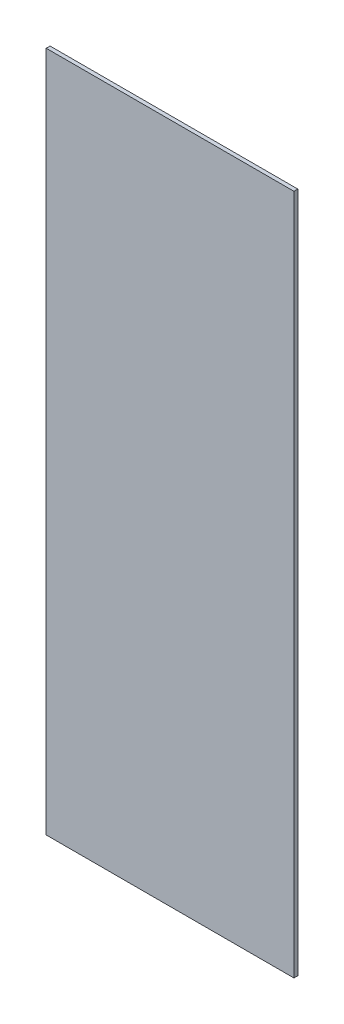
ISO-10303-21;
HEADER;
FILE_DESCRIPTION(('STEP AP214'),'2;1');
FILE_NAME('part.step','',(''),(''),'','','');
FILE_SCHEMA(('AUTOMOTIVE_DESIGN { 1 0 10303 214 1 1 1 1 }'));
ENDSEC;
DATA;
#1=APPLICATION_CONTEXT('core data for automotive mechanical design processes');
#2=APPLICATION_PROTOCOL_DEFINITION('international standard','automotive_design',2000,#1);
#3=PRODUCT_CONTEXT('',#1,'mechanical');
#4=PRODUCT('Part','Part','',(#3));
#5=PRODUCT_RELATED_PRODUCT_CATEGORY('part','',(#4));
#6=PRODUCT_DEFINITION_FORMATION('','',#4);
#7=PRODUCT_DEFINITION_CONTEXT('part definition',#1,'design');
#8=PRODUCT_DEFINITION('design','',#6,#7);
#9=PRODUCT_DEFINITION_SHAPE('','',#8);
#10=(LENGTH_UNIT() NAMED_UNIT(*) SI_UNIT(.MILLI.,.METRE.));
#11=(NAMED_UNIT(*) PLANE_ANGLE_UNIT() SI_UNIT($,.RADIAN.));
#12=(NAMED_UNIT(*) SI_UNIT($,.STERADIAN.) SOLID_ANGLE_UNIT());
#13=UNCERTAINTY_MEASURE_WITH_UNIT(LENGTH_MEASURE(1.E-05),#10,'distance_accuracy_value','');
#14=(GEOMETRIC_REPRESENTATION_CONTEXT(3) GLOBAL_UNCERTAINTY_ASSIGNED_CONTEXT((#13)) GLOBAL_UNIT_ASSIGNED_CONTEXT((#10,
#11,#12)) REPRESENTATION_CONTEXT('',''));
#15=CARTESIAN_POINT('',(0.,0.,0.));
#16=DIRECTION('',(0.,0.,1.));
#17=DIRECTION('',(1.,0.,0.));
#18=AXIS2_PLACEMENT_3D('',#15,#16,#17);
#19=CARTESIAN_POINT('',(0.,0.,0.79375));
#20=DIRECTION('',(1.,0.,0.));
#21=DIRECTION('',(0.,0.,-1.));
#22=AXIS2_PLACEMENT_3D('',#19,#20,#21);
#23=PLANE('',#22);
#24=DIRECTION('',(0.,-1.,0.));
#25=VECTOR('',#24,1.);
#26=CARTESIAN_POINT('',(0.,0.,0.));
#27=LINE('',#26,#25);
#28=CARTESIAN_POINT('',(0.,139.7,0.));
#29=VERTEX_POINT('',#28);
#30=CARTESIAN_POINT('',(0.,0.,0.));
#31=VERTEX_POINT('',#30);
#32=EDGE_CURVE('E91',#29,#31,#27,.T.);
#33=ORIENTED_EDGE('',*,*,#32,.T.);
#34=DIRECTION('',(0.,0.,-1.));
#35=VECTOR('',#34,1.);
#36=CARTESIAN_POINT('',(0.,0.,0.79375));
#37=LINE('',#36,#35);
#38=CARTESIAN_POINT('',(0.,0.,0.79375));
#39=VERTEX_POINT('',#38);
#40=EDGE_CURVE('E11',#39,#31,#37,.T.);
#41=ORIENTED_EDGE('',*,*,#40,.F.);
#42=DIRECTION('',(0.,-1.,0.));
#43=VECTOR('',#42,1.);
#44=CARTESIAN_POINT('',(0.,0.,0.79375));
#45=LINE('',#44,#43);
#46=CARTESIAN_POINT('',(0.,139.7,0.79375));
#47=VERTEX_POINT('',#46);
#48=EDGE_CURVE('E79',#47,#39,#45,.T.);
#49=ORIENTED_EDGE('',*,*,#48,.F.);
#50=DIRECTION('',(0.,0.,-1.));
#51=VECTOR('',#50,1.);
#52=CARTESIAN_POINT('',(0.,139.7,0.79375));
#53=LINE('',#52,#51);
#54=EDGE_CURVE('E87',#47,#29,#53,.T.);
#55=ORIENTED_EDGE('',*,*,#54,.T.);
#56=EDGE_LOOP('',(#33,#41,#49,#55));
#57=FACE_BOUND('',#56,.T.);
#58=ADVANCED_FACE('F28',(#57),#23,.F.);
#59=CARTESIAN_POINT('',(0.,0.,0.79375));
#60=DIRECTION('',(0.,1.,0.));
#61=DIRECTION('',(0.,0.,1.));
#62=AXIS2_PLACEMENT_3D('',#59,#60,#61);
#63=PLANE('',#62);
#64=DIRECTION('',(1.,0.,0.));
#65=VECTOR('',#64,1.);
#66=CARTESIAN_POINT('',(0.,0.,0.));
#67=LINE('',#66,#65);
#68=CARTESIAN_POINT('',(50.8,0.,0.));
#69=VERTEX_POINT('',#68);
#70=EDGE_CURVE('E83',#31,#69,#67,.T.);
#71=ORIENTED_EDGE('',*,*,#70,.T.);
#72=DIRECTION('',(0.,0.,-1.));
#73=VECTOR('',#72,1.);
#74=CARTESIAN_POINT('',(50.8,0.,0.79375));
#75=LINE('',#74,#73);
#76=CARTESIAN_POINT('',(50.8,0.,0.79375));
#77=VERTEX_POINT('',#76);
#78=EDGE_CURVE('E36',#77,#69,#75,.T.);
#79=ORIENTED_EDGE('',*,*,#78,.F.);
#80=DIRECTION('',(1.,0.,0.));
#81=VECTOR('',#80,1.);
#82=CARTESIAN_POINT('',(0.,0.,0.79375));
#83=LINE('',#82,#81);
#84=EDGE_CURVE('E74',#39,#77,#83,.T.);
#85=ORIENTED_EDGE('',*,*,#84,.F.);
#86=ORIENTED_EDGE('',*,*,#40,.T.);
#87=EDGE_LOOP('',(#71,#79,#85,#86));
#88=FACE_BOUND('',#87,.T.);
#89=ADVANCED_FACE('F82',(#88),#63,.F.);
#90=CARTESIAN_POINT('',(50.8,0.,0.79375));
#91=DIRECTION('',(-1.,0.,0.));
#92=DIRECTION('',(0.,0.,1.));
#93=AXIS2_PLACEMENT_3D('',#90,#91,#92);
#94=PLANE('',#93);
#95=DIRECTION('',(0.,1.,0.));
#96=VECTOR('',#95,1.);
#97=CARTESIAN_POINT('',(50.8,0.,0.));
#98=LINE('',#97,#96);
#99=CARTESIAN_POINT('',(50.8,139.7,0.));
#100=VERTEX_POINT('',#99);
#101=EDGE_CURVE('E61',#69,#100,#98,.T.);
#102=ORIENTED_EDGE('',*,*,#101,.T.);
#103=DIRECTION('',(0.,0.,-1.));
#104=VECTOR('',#103,1.);
#105=CARTESIAN_POINT('',(50.8,139.7,0.79375));
#106=LINE('',#105,#104);
#107=CARTESIAN_POINT('',(50.8,139.7,0.79375));
#108=VERTEX_POINT('',#107);
#109=EDGE_CURVE('E84',#108,#100,#106,.T.);
#110=ORIENTED_EDGE('',*,*,#109,.F.);
#111=DIRECTION('',(0.,1.,0.));
#112=VECTOR('',#111,1.);
#113=CARTESIAN_POINT('',(50.8,0.,0.79375));
#114=LINE('',#113,#112);
#115=EDGE_CURVE('E77',#77,#108,#114,.T.);
#116=ORIENTED_EDGE('',*,*,#115,.F.);
#117=ORIENTED_EDGE('',*,*,#78,.T.);
#118=EDGE_LOOP('',(#102,#110,#116,#117));
#119=FACE_BOUND('',#118,.T.);
#120=ADVANCED_FACE('F85',(#119),#94,.F.);
#121=CARTESIAN_POINT('',(0.,139.7,0.79375));
#122=DIRECTION('',(0.,-1.,0.));
#123=DIRECTION('',(0.,0.,-1.));
#124=AXIS2_PLACEMENT_3D('',#121,#122,#123);
#125=PLANE('',#124);
#126=DIRECTION('',(-1.,0.,0.));
#127=VECTOR('',#126,1.);
#128=CARTESIAN_POINT('',(0.,139.7,0.));
#129=LINE('',#128,#127);
#130=EDGE_CURVE('E67',#100,#29,#129,.T.);
#131=ORIENTED_EDGE('',*,*,#130,.T.);
#132=ORIENTED_EDGE('',*,*,#54,.F.);
#133=DIRECTION('',(-1.,0.,0.));
#134=VECTOR('',#133,1.);
#135=CARTESIAN_POINT('',(0.,139.7,0.79375));
#136=LINE('',#135,#134);
#137=EDGE_CURVE('E44',#108,#47,#136,.T.);
#138=ORIENTED_EDGE('',*,*,#137,.F.);
#139=ORIENTED_EDGE('',*,*,#109,.T.);
#140=EDGE_LOOP('',(#131,#132,#138,#139));
#141=FACE_BOUND('',#140,.T.);
#142=ADVANCED_FACE('F98',(#141),#125,.F.);
#143=CARTESIAN_POINT('',(0.,0.,0.79375));
#144=DIRECTION('',(0.,0.,-1.));
#145=DIRECTION('',(-1.,0.,0.));
#146=AXIS2_PLACEMENT_3D('',#143,#144,#145);
#147=PLANE('',#146);
#148=ORIENTED_EDGE('',*,*,#48,.T.);
#149=ORIENTED_EDGE('',*,*,#84,.T.);
#150=ORIENTED_EDGE('',*,*,#115,.T.);
#151=ORIENTED_EDGE('',*,*,#137,.T.);
#152=EDGE_LOOP('',(#148,#149,#150,#151));
#153=FACE_BOUND('',#152,.T.);
#154=ADVANCED_FACE('F75',(#153),#147,.F.);
#155=CARTESIAN_POINT('',(0.,0.,0.));
#156=DIRECTION('',(0.,0.,-1.));
#157=DIRECTION('',(-1.,0.,0.));
#158=AXIS2_PLACEMENT_3D('',#155,#156,#157);
#159=PLANE('',#158);
#160=ORIENTED_EDGE('',*,*,#32,.F.);
#161=ORIENTED_EDGE('',*,*,#130,.F.);
#162=ORIENTED_EDGE('',*,*,#101,.F.);
#163=ORIENTED_EDGE('',*,*,#70,.F.);
#164=EDGE_LOOP('',(#160,#161,#162,#163));
#165=FACE_BOUND('',#164,.T.);
#166=ADVANCED_FACE('F101',(#165),#159,.T.);
#167=CLOSED_SHELL('',(#58,#89,#120,#142,#154,#166));
#168=MANIFOLD_SOLID_BREP('B2',#167);
#169=ADVANCED_BREP_SHAPE_REPRESENTATION('',(#18,#168),#14);
#170=SHAPE_DEFINITION_REPRESENTATION(#9,#169);
ENDSEC;
END-ISO-10303-21;
